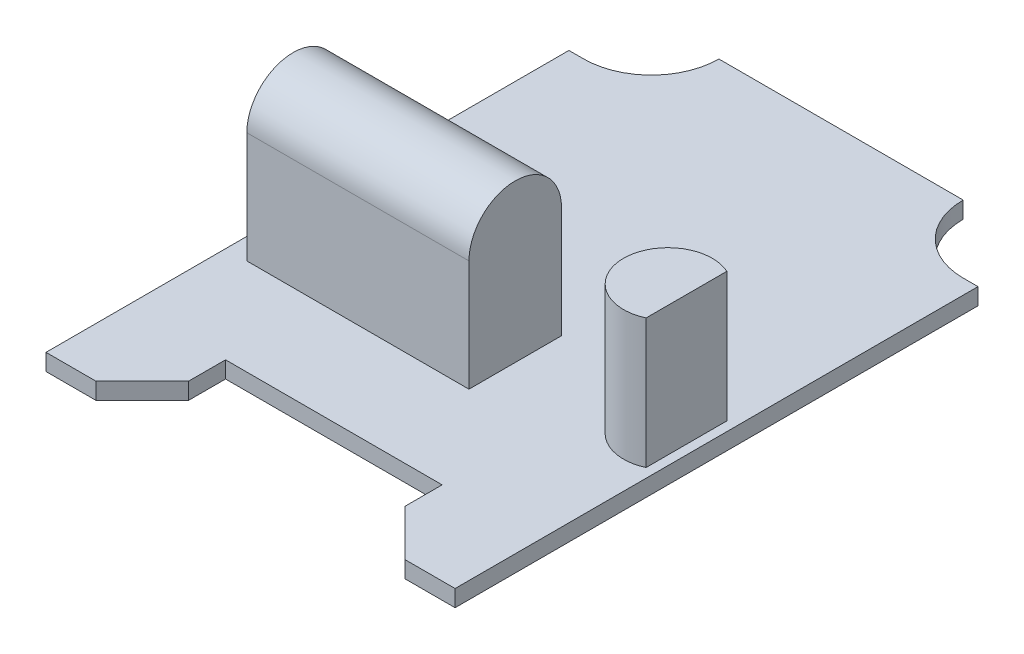
ISO-10303-21;
HEADER;
FILE_DESCRIPTION(('STEP AP214'),'2;1');
FILE_NAME('part.step','',(''),(''),'','','');
FILE_SCHEMA(('AUTOMOTIVE_DESIGN { 1 0 10303 214 1 1 1 1 }'));
ENDSEC;
DATA;
#1=APPLICATION_CONTEXT('core data for automotive mechanical design processes');
#2=APPLICATION_PROTOCOL_DEFINITION('international standard','automotive_design',2000,#1);
#3=PRODUCT_CONTEXT('',#1,'mechanical');
#4=PRODUCT('Part','Part','',(#3));
#5=PRODUCT_RELATED_PRODUCT_CATEGORY('part','',(#4));
#6=PRODUCT_DEFINITION_FORMATION('','',#4);
#7=PRODUCT_DEFINITION_CONTEXT('part definition',#1,'design');
#8=PRODUCT_DEFINITION('design','',#6,#7);
#9=PRODUCT_DEFINITION_SHAPE('','',#8);
#10=(LENGTH_UNIT() NAMED_UNIT(*) SI_UNIT(.MILLI.,.METRE.));
#11=(NAMED_UNIT(*) PLANE_ANGLE_UNIT() SI_UNIT($,.RADIAN.));
#12=(NAMED_UNIT(*) SI_UNIT($,.STERADIAN.) SOLID_ANGLE_UNIT());
#13=UNCERTAINTY_MEASURE_WITH_UNIT(LENGTH_MEASURE(1.E-05),#10,'distance_accuracy_value','');
#14=(GEOMETRIC_REPRESENTATION_CONTEXT(3) GLOBAL_UNCERTAINTY_ASSIGNED_CONTEXT((#13)) GLOBAL_UNIT_ASSIGNED_CONTEXT((#10,
#11,#12)) REPRESENTATION_CONTEXT('',''));
#15=CARTESIAN_POINT('',(0.,0.,0.));
#16=DIRECTION('',(0.,0.,1.));
#17=DIRECTION('',(1.,0.,0.));
#18=AXIS2_PLACEMENT_3D('',#15,#16,#17);
#19=CARTESIAN_POINT('',(-10.25,0.9,-31.9));
#20=DIRECTION('',(0.,-1.,0.));
#21=DIRECTION('',(0.,0.,-1.));
#22=AXIS2_PLACEMENT_3D('',#19,#20,#21);
#23=PLANE('',#22);
#24=DIRECTION('',(1.,0.,0.));
#25=VECTOR('',#24,1.);
#26=CARTESIAN_POINT('',(-8.34999999999999,0.9,0.));
#27=LINE('',#26,#25);
#28=CARTESIAN_POINT('',(-11.05,0.9,0.));
#29=VERTEX_POINT('',#28);
#30=CARTESIAN_POINT('',(-8.34999999999999,0.9,0.));
#31=VERTEX_POINT('',#30);
#32=EDGE_CURVE('E222',#29,#31,#27,.T.);
#33=ORIENTED_EDGE('',*,*,#32,.T.);
#34=DIRECTION('',(0.707106781186546,0.,-0.707106781186549));
#35=VECTOR('',#34,1.);
#36=CARTESIAN_POINT('',(-5.85,0.9,-2.5));
#37=LINE('',#36,#35);
#38=CARTESIAN_POINT('',(-5.85,0.9,-2.5));
#39=VERTEX_POINT('',#38);
#40=EDGE_CURVE('E225',#31,#39,#37,.T.);
#41=ORIENTED_EDGE('',*,*,#40,.T.);
#42=DIRECTION('',(0.,0.,-1.));
#43=VECTOR('',#42,1.);
#44=CARTESIAN_POINT('',(-5.85,0.9,-4.5));
#45=LINE('',#44,#43);
#46=CARTESIAN_POINT('',(-5.85,0.9,-4.5));
#47=VERTEX_POINT('',#46);
#48=EDGE_CURVE('E228',#39,#47,#45,.T.);
#49=ORIENTED_EDGE('',*,*,#48,.T.);
#50=DIRECTION('',(1.,0.,0.));
#51=VECTOR('',#50,1.);
#52=CARTESIAN_POINT('',(-5.85,0.9,-4.5));
#53=LINE('',#52,#51);
#54=CARTESIAN_POINT('',(5.85,0.9,-4.5));
#55=VERTEX_POINT('',#54);
#56=EDGE_CURVE('E230',#47,#55,#53,.T.);
#57=ORIENTED_EDGE('',*,*,#56,.T.);
#58=DIRECTION('',(0.,0.,1.));
#59=VECTOR('',#58,1.);
#60=CARTESIAN_POINT('',(5.85,0.9,-4.5));
#61=LINE('',#60,#59);
#62=CARTESIAN_POINT('',(5.85,0.9,-2.5));
#63=VERTEX_POINT('',#62);
#64=EDGE_CURVE('E232',#55,#63,#61,.T.);
#65=ORIENTED_EDGE('',*,*,#64,.T.);
#66=DIRECTION('',(0.707106781186546,0.,0.707106781186549));
#67=VECTOR('',#66,1.);
#68=CARTESIAN_POINT('',(5.85,0.9,-2.5));
#69=LINE('',#68,#67);
#70=CARTESIAN_POINT('',(8.34999999999999,0.9,0.));
#71=VERTEX_POINT('',#70);
#72=EDGE_CURVE('E234',#63,#71,#69,.T.);
#73=ORIENTED_EDGE('',*,*,#72,.T.);
#74=DIRECTION('',(1.,0.,0.));
#75=VECTOR('',#74,1.);
#76=CARTESIAN_POINT('',(8.34999999999999,0.9,0.));
#77=LINE('',#76,#75);
#78=CARTESIAN_POINT('',(11.05,0.9,0.));
#79=VERTEX_POINT('',#78);
#80=EDGE_CURVE('E236',#71,#79,#77,.T.);
#81=ORIENTED_EDGE('',*,*,#80,.T.);
#82=DIRECTION('',(0.,0.,-1.));
#83=VECTOR('',#82,1.);
#84=CARTESIAN_POINT('',(11.05,0.9,0.));
#85=LINE('',#84,#83);
#86=CARTESIAN_POINT('',(11.05,0.9,-28.25));
#87=VERTEX_POINT('',#86);
#88=EDGE_CURVE('E238',#79,#87,#85,.T.);
#89=ORIENTED_EDGE('',*,*,#88,.T.);
#90=DIRECTION('',(-1.,0.,0.));
#91=VECTOR('',#90,1.);
#92=CARTESIAN_POINT('',(11.05,0.9,-28.25));
#93=LINE('',#92,#91);
#94=CARTESIAN_POINT('',(10.25,0.9,-28.25));
#95=VERTEX_POINT('',#94);
#96=EDGE_CURVE('E240',#87,#95,#93,.T.);
#97=ORIENTED_EDGE('',*,*,#96,.T.);
#98=CARTESIAN_POINT('',(10.25,0.9,-31.9));
#99=DIRECTION('',(0.,-1.,0.));
#100=DIRECTION('',(0.,0.,1.));
#101=AXIS2_PLACEMENT_3D('',#98,#99,#100);
#102=CIRCLE('',#101,3.65);
#103=CARTESIAN_POINT('',(6.6,0.9,-31.9));
#104=VERTEX_POINT('',#103);
#105=EDGE_CURVE('E242',#95,#104,#102,.T.);
#106=ORIENTED_EDGE('',*,*,#105,.T.);
#107=DIRECTION('',(-1.,0.,0.));
#108=VECTOR('',#107,1.);
#109=CARTESIAN_POINT('',(-6.6,0.9,-31.9));
#110=LINE('',#109,#108);
#111=CARTESIAN_POINT('',(-6.6,0.9,-31.9));
#112=VERTEX_POINT('',#111);
#113=EDGE_CURVE('E244',#104,#112,#110,.T.);
#114=ORIENTED_EDGE('',*,*,#113,.T.);
#115=CARTESIAN_POINT('',(-10.25,0.9,-31.9));
#116=DIRECTION('',(0.,-1.,0.));
#117=DIRECTION('',(0.,0.,-1.));
#118=AXIS2_PLACEMENT_3D('',#115,#116,#117);
#119=CIRCLE('',#118,3.65);
#120=CARTESIAN_POINT('',(-10.25,0.9,-28.25));
#121=VERTEX_POINT('',#120);
#122=EDGE_CURVE('E246',#112,#121,#119,.T.);
#123=ORIENTED_EDGE('',*,*,#122,.T.);
#124=DIRECTION('',(-1.,0.,0.));
#125=VECTOR('',#124,1.);
#126=CARTESIAN_POINT('',(-11.05,0.9,-28.25));
#127=LINE('',#126,#125);
#128=CARTESIAN_POINT('',(-11.05,0.9,-28.25));
#129=VERTEX_POINT('',#128);
#130=EDGE_CURVE('E248',#121,#129,#127,.T.);
#131=ORIENTED_EDGE('',*,*,#130,.T.);
#132=DIRECTION('',(0.,0.,1.));
#133=VECTOR('',#132,1.);
#134=CARTESIAN_POINT('',(-11.05,0.9,0.));
#135=LINE('',#134,#133);
#136=EDGE_CURVE('E250',#129,#29,#135,.T.);
#137=ORIENTED_EDGE('',*,*,#136,.T.);
#138=EDGE_LOOP('',(#33,#41,#49,#57,#65,#73,#81,#89,#97,#106,#114,#123,#131,#137));
#139=FACE_BOUND('',#138,.T.);
#140=DIRECTION('',(-1.,0.,0.));
#141=VECTOR('',#140,1.);
#142=CARTESIAN_POINT('',(2.1,0.9,-14.7));
#143=LINE('',#142,#141);
#144=CARTESIAN_POINT('',(2.1,0.9,-14.7));
#145=VERTEX_POINT('',#144);
#146=CARTESIAN_POINT('',(-9.9,0.9,-14.7));
#147=VERTEX_POINT('',#146);
#148=EDGE_CURVE('E56',#145,#147,#143,.T.);
#149=ORIENTED_EDGE('',*,*,#148,.F.);
#150=DIRECTION('',(0.,0.,1.));
#151=VECTOR('',#150,1.);
#152=CARTESIAN_POINT('',(2.1,0.9,-14.7));
#153=LINE('',#152,#151);
#154=CARTESIAN_POINT('',(2.1,0.9,-9.7));
#155=VERTEX_POINT('',#154);
#156=EDGE_CURVE('E195',#145,#155,#153,.T.);
#157=ORIENTED_EDGE('',*,*,#156,.T.);
#158=DIRECTION('',(-1.,0.,0.));
#159=VECTOR('',#158,1.);
#160=CARTESIAN_POINT('',(2.1,0.9,-9.7));
#161=LINE('',#160,#159);
#162=CARTESIAN_POINT('',(-9.9,0.9,-9.7));
#163=VERTEX_POINT('',#162);
#164=EDGE_CURVE('E206',#155,#163,#161,.T.);
#165=ORIENTED_EDGE('',*,*,#164,.T.);
#166=DIRECTION('',(0.,0.,1.));
#167=VECTOR('',#166,1.);
#168=CARTESIAN_POINT('',(-9.9,0.9,-14.7));
#169=LINE('',#168,#167);
#170=EDGE_CURVE('E187',#147,#163,#169,.T.);
#171=ORIENTED_EDGE('',*,*,#170,.F.);
#172=EDGE_LOOP('',(#149,#157,#165,#171));
#173=FACE_BOUND('',#172,.T.);
#174=CARTESIAN_POINT('',(9.55,0.9,-13.));
#175=DIRECTION('',(0.,1.,0.));
#176=DIRECTION('',(0.,0.,1.));
#177=AXIS2_PLACEMENT_3D('',#174,#175,#176);
#178=CIRCLE('',#177,2.4);
#179=CARTESIAN_POINT('',(10.55,0.9,-15.1817424229271));
#180=VERTEX_POINT('',#179);
#181=CARTESIAN_POINT('',(10.55,0.9,-10.8182575770729));
#182=VERTEX_POINT('',#181);
#183=EDGE_CURVE('E186',#180,#182,#178,.T.);
#184=ORIENTED_EDGE('',*,*,#183,.F.);
#185=DIRECTION('',(0.,0.,-1.));
#186=VECTOR('',#185,1.);
#187=CARTESIAN_POINT('',(10.55,0.9,-15.1817424229271));
#188=LINE('',#187,#186);
#189=EDGE_CURVE('E48',#182,#180,#188,.T.);
#190=ORIENTED_EDGE('',*,*,#189,.F.);
#191=EDGE_LOOP('',(#184,#190));
#192=FACE_BOUND('',#191,.T.);
#193=ADVANCED_FACE('F34',(#139,#173,#192),#23,.F.);
#194=CARTESIAN_POINT('',(-8.34999999999999,0.9,0.));
#195=DIRECTION('',(0.,0.,-1.));
#196=DIRECTION('',(-1.,0.,0.));
#197=AXIS2_PLACEMENT_3D('',#194,#195,#196);
#198=PLANE('',#197);
#199=DIRECTION('',(1.,0.,0.));
#200=VECTOR('',#199,1.);
#201=CARTESIAN_POINT('',(-8.34999999999999,0.,0.));
#202=LINE('',#201,#200);
#203=CARTESIAN_POINT('',(-11.05,0.,0.));
#204=VERTEX_POINT('',#203);
#205=CARTESIAN_POINT('',(-8.34999999999999,0.,0.));
#206=VERTEX_POINT('',#205);
#207=EDGE_CURVE('E216',#204,#206,#202,.T.);
#208=ORIENTED_EDGE('',*,*,#207,.T.);
#209=DIRECTION('',(0.,-1.,0.));
#210=VECTOR('',#209,1.);
#211=CARTESIAN_POINT('',(-8.34999999999999,0.9,0.));
#212=LINE('',#211,#210);
#213=EDGE_CURVE('E11',#31,#206,#212,.T.);
#214=ORIENTED_EDGE('',*,*,#213,.F.);
#215=ORIENTED_EDGE('',*,*,#32,.F.);
#216=DIRECTION('',(0.,-1.,0.));
#217=VECTOR('',#216,1.);
#218=CARTESIAN_POINT('',(-11.05,0.9,0.));
#219=LINE('',#218,#217);
#220=EDGE_CURVE('E252',#29,#204,#219,.T.);
#221=ORIENTED_EDGE('',*,*,#220,.T.);
#222=EDGE_LOOP('',(#208,#214,#215,#221));
#223=FACE_BOUND('',#222,.T.);
#224=ADVANCED_FACE('F36',(#223),#198,.F.);
#225=CARTESIAN_POINT('',(-5.85,0.9,-2.5));
#226=DIRECTION('',(-0.707106781186549,0.,-0.707106781186546));
#227=DIRECTION('',(-0.707106781186546,0.,0.707106781186549));
#228=AXIS2_PLACEMENT_3D('',#225,#226,#227);
#229=PLANE('',#228);
#230=DIRECTION('',(0.707106781186546,0.,-0.707106781186549));
#231=VECTOR('',#230,1.);
#232=CARTESIAN_POINT('',(-5.85,0.,-2.5));
#233=LINE('',#232,#231);
#234=CARTESIAN_POINT('',(-5.85,0.,-2.5));
#235=VERTEX_POINT('',#234);
#236=EDGE_CURVE('E255',#206,#235,#233,.T.);
#237=ORIENTED_EDGE('',*,*,#236,.T.);
#238=DIRECTION('',(0.,-1.,0.));
#239=VECTOR('',#238,1.);
#240=CARTESIAN_POINT('',(-5.85,0.9,-2.5));
#241=LINE('',#240,#239);
#242=EDGE_CURVE('E42',#39,#235,#241,.T.);
#243=ORIENTED_EDGE('',*,*,#242,.F.);
#244=ORIENTED_EDGE('',*,*,#40,.F.);
#245=ORIENTED_EDGE('',*,*,#213,.T.);
#246=EDGE_LOOP('',(#237,#243,#244,#245));
#247=FACE_BOUND('',#246,.T.);
#248=ADVANCED_FACE('F341',(#247),#229,.F.);
#249=CARTESIAN_POINT('',(-5.85,0.9,-4.5));
#250=DIRECTION('',(-1.,0.,0.));
#251=DIRECTION('',(0.,0.,1.));
#252=AXIS2_PLACEMENT_3D('',#249,#250,#251);
#253=PLANE('',#252);
#254=DIRECTION('',(0.,0.,-1.));
#255=VECTOR('',#254,1.);
#256=CARTESIAN_POINT('',(-5.85,0.,-4.5));
#257=LINE('',#256,#255);
#258=CARTESIAN_POINT('',(-5.85,0.,-4.5));
#259=VERTEX_POINT('',#258);
#260=EDGE_CURVE('E257',#235,#259,#257,.T.);
#261=ORIENTED_EDGE('',*,*,#260,.T.);
#262=DIRECTION('',(0.,-1.,0.));
#263=VECTOR('',#262,1.);
#264=CARTESIAN_POINT('',(-5.85,0.9,-4.5));
#265=LINE('',#264,#263);
#266=EDGE_CURVE('E312',#47,#259,#265,.T.);
#267=ORIENTED_EDGE('',*,*,#266,.F.);
#268=ORIENTED_EDGE('',*,*,#48,.F.);
#269=ORIENTED_EDGE('',*,*,#242,.T.);
#270=EDGE_LOOP('',(#261,#267,#268,#269));
#271=FACE_BOUND('',#270,.T.);
#272=ADVANCED_FACE('F319',(#271),#253,.F.);
#273=CARTESIAN_POINT('',(-5.85,0.9,-4.5));
#274=DIRECTION('',(0.,0.,-1.));
#275=DIRECTION('',(-1.,0.,0.));
#276=AXIS2_PLACEMENT_3D('',#273,#274,#275);
#277=PLANE('',#276);
#278=DIRECTION('',(1.,0.,0.));
#279=VECTOR('',#278,1.);
#280=CARTESIAN_POINT('',(-5.85,0.,-4.5));
#281=LINE('',#280,#279);
#282=CARTESIAN_POINT('',(5.85,0.,-4.5));
#283=VERTEX_POINT('',#282);
#284=EDGE_CURVE('E259',#259,#283,#281,.T.);
#285=ORIENTED_EDGE('',*,*,#284,.T.);
#286=DIRECTION('',(0.,-1.,0.));
#287=VECTOR('',#286,1.);
#288=CARTESIAN_POINT('',(5.85,0.9,-4.5));
#289=LINE('',#288,#287);
#290=EDGE_CURVE('E309',#55,#283,#289,.T.);
#291=ORIENTED_EDGE('',*,*,#290,.F.);
#292=ORIENTED_EDGE('',*,*,#56,.F.);
#293=ORIENTED_EDGE('',*,*,#266,.T.);
#294=EDGE_LOOP('',(#285,#291,#292,#293));
#295=FACE_BOUND('',#294,.T.);
#296=ADVANCED_FACE('F330',(#295),#277,.F.);
#297=CARTESIAN_POINT('',(5.85,0.9,-4.5));
#298=DIRECTION('',(1.,0.,0.));
#299=DIRECTION('',(0.,0.,-1.));
#300=AXIS2_PLACEMENT_3D('',#297,#298,#299);
#301=PLANE('',#300);
#302=DIRECTION('',(0.,0.,1.));
#303=VECTOR('',#302,1.);
#304=CARTESIAN_POINT('',(5.85,0.,-4.5));
#305=LINE('',#304,#303);
#306=CARTESIAN_POINT('',(5.85,0.,-2.5));
#307=VERTEX_POINT('',#306);
#308=EDGE_CURVE('E261',#283,#307,#305,.T.);
#309=ORIENTED_EDGE('',*,*,#308,.T.);
#310=DIRECTION('',(0.,-1.,0.));
#311=VECTOR('',#310,1.);
#312=CARTESIAN_POINT('',(5.85,0.9,-2.5));
#313=LINE('',#312,#311);
#314=EDGE_CURVE('E306',#63,#307,#313,.T.);
#315=ORIENTED_EDGE('',*,*,#314,.F.);
#316=ORIENTED_EDGE('',*,*,#64,.F.);
#317=ORIENTED_EDGE('',*,*,#290,.T.);
#318=EDGE_LOOP('',(#309,#315,#316,#317));
#319=FACE_BOUND('',#318,.T.);
#320=ADVANCED_FACE('F334',(#319),#301,.F.);
#321=CARTESIAN_POINT('',(5.85,0.9,-2.5));
#322=DIRECTION('',(0.707106781186549,0.,-0.707106781186546));
#323=DIRECTION('',(-0.707106781186546,0.,-0.707106781186549));
#324=AXIS2_PLACEMENT_3D('',#321,#322,#323);
#325=PLANE('',#324);
#326=DIRECTION('',(0.707106781186546,0.,0.707106781186549));
#327=VECTOR('',#326,1.);
#328=CARTESIAN_POINT('',(5.85,0.,-2.5));
#329=LINE('',#328,#327);
#330=CARTESIAN_POINT('',(8.34999999999999,0.,0.));
#331=VERTEX_POINT('',#330);
#332=EDGE_CURVE('E263',#307,#331,#329,.T.);
#333=ORIENTED_EDGE('',*,*,#332,.T.);
#334=DIRECTION('',(0.,-1.,0.));
#335=VECTOR('',#334,1.);
#336=CARTESIAN_POINT('',(8.34999999999999,0.9,0.));
#337=LINE('',#336,#335);
#338=EDGE_CURVE('E303',#71,#331,#337,.T.);
#339=ORIENTED_EDGE('',*,*,#338,.F.);
#340=ORIENTED_EDGE('',*,*,#72,.F.);
#341=ORIENTED_EDGE('',*,*,#314,.T.);
#342=EDGE_LOOP('',(#333,#339,#340,#341));
#343=FACE_BOUND('',#342,.T.);
#344=ADVANCED_FACE('F384',(#343),#325,.F.);
#345=CARTESIAN_POINT('',(8.34999999999999,0.9,0.));
#346=DIRECTION('',(0.,0.,-1.));
#347=DIRECTION('',(-1.,0.,0.));
#348=AXIS2_PLACEMENT_3D('',#345,#346,#347);
#349=PLANE('',#348);
#350=DIRECTION('',(1.,0.,0.));
#351=VECTOR('',#350,1.);
#352=CARTESIAN_POINT('',(8.34999999999999,0.,0.));
#353=LINE('',#352,#351);
#354=CARTESIAN_POINT('',(11.05,0.,0.));
#355=VERTEX_POINT('',#354);
#356=EDGE_CURVE('E265',#331,#355,#353,.T.);
#357=ORIENTED_EDGE('',*,*,#356,.T.);
#358=DIRECTION('',(0.,-1.,0.));
#359=VECTOR('',#358,1.);
#360=CARTESIAN_POINT('',(11.05,0.9,0.));
#361=LINE('',#360,#359);
#362=EDGE_CURVE('E300',#79,#355,#361,.T.);
#363=ORIENTED_EDGE('',*,*,#362,.F.);
#364=ORIENTED_EDGE('',*,*,#80,.F.);
#365=ORIENTED_EDGE('',*,*,#338,.T.);
#366=EDGE_LOOP('',(#357,#363,#364,#365));
#367=FACE_BOUND('',#366,.T.);
#368=ADVANCED_FACE('F382',(#367),#349,.F.);
#369=CARTESIAN_POINT('',(11.05,0.9,0.));
#370=DIRECTION('',(-1.,0.,0.));
#371=DIRECTION('',(0.,0.,1.));
#372=AXIS2_PLACEMENT_3D('',#369,#370,#371);
#373=PLANE('',#372);
#374=DIRECTION('',(0.,0.,-1.));
#375=VECTOR('',#374,1.);
#376=CARTESIAN_POINT('',(11.05,0.,0.));
#377=LINE('',#376,#375);
#378=CARTESIAN_POINT('',(11.05,0.,-28.25));
#379=VERTEX_POINT('',#378);
#380=EDGE_CURVE('E267',#355,#379,#377,.T.);
#381=ORIENTED_EDGE('',*,*,#380,.T.);
#382=DIRECTION('',(0.,-1.,0.));
#383=VECTOR('',#382,1.);
#384=CARTESIAN_POINT('',(11.05,0.9,-28.25));
#385=LINE('',#384,#383);
#386=EDGE_CURVE('E297',#87,#379,#385,.T.);
#387=ORIENTED_EDGE('',*,*,#386,.F.);
#388=ORIENTED_EDGE('',*,*,#88,.F.);
#389=ORIENTED_EDGE('',*,*,#362,.T.);
#390=EDGE_LOOP('',(#381,#387,#388,#389));
#391=FACE_BOUND('',#390,.T.);
#392=ADVANCED_FACE('F377',(#391),#373,.F.);
#393=CARTESIAN_POINT('',(11.05,0.9,-28.25));
#394=DIRECTION('',(0.,0.,1.));
#395=DIRECTION('',(1.,0.,0.));
#396=AXIS2_PLACEMENT_3D('',#393,#394,#395);
#397=PLANE('',#396);
#398=DIRECTION('',(-1.,0.,0.));
#399=VECTOR('',#398,1.);
#400=CARTESIAN_POINT('',(11.05,0.,-28.25));
#401=LINE('',#400,#399);
#402=CARTESIAN_POINT('',(10.25,0.,-28.25));
#403=VERTEX_POINT('',#402);
#404=EDGE_CURVE('E269',#379,#403,#401,.T.);
#405=ORIENTED_EDGE('',*,*,#404,.T.);
#406=DIRECTION('',(0.,-1.,0.));
#407=VECTOR('',#406,1.);
#408=CARTESIAN_POINT('',(10.25,0.9,-28.25));
#409=LINE('',#408,#407);
#410=EDGE_CURVE('E294',#95,#403,#409,.T.);
#411=ORIENTED_EDGE('',*,*,#410,.F.);
#412=ORIENTED_EDGE('',*,*,#96,.F.);
#413=ORIENTED_EDGE('',*,*,#386,.T.);
#414=EDGE_LOOP('',(#405,#411,#412,#413));
#415=FACE_BOUND('',#414,.T.);
#416=ADVANCED_FACE('F372',(#415),#397,.F.);
#417=CARTESIAN_POINT('',(10.25,0.9,-31.9));
#418=DIRECTION('',(0.,-1.,0.));
#419=DIRECTION('',(0.,0.,-1.));
#420=AXIS2_PLACEMENT_3D('',#417,#418,#419);
#421=CYLINDRICAL_SURFACE('',#420,3.65);
#422=CARTESIAN_POINT('',(10.25,0.,-31.9));
#423=DIRECTION('',(0.,-1.,0.));
#424=DIRECTION('',(0.,0.,1.));
#425=AXIS2_PLACEMENT_3D('',#422,#423,#424);
#426=CIRCLE('',#425,3.65);
#427=CARTESIAN_POINT('',(6.6,0.,-31.9));
#428=VERTEX_POINT('',#427);
#429=EDGE_CURVE('E271',#403,#428,#426,.T.);
#430=ORIENTED_EDGE('',*,*,#429,.T.);
#431=DIRECTION('',(0.,-1.,0.));
#432=VECTOR('',#431,1.);
#433=CARTESIAN_POINT('',(6.6,0.9,-31.9));
#434=LINE('',#433,#432);
#435=EDGE_CURVE('E291',#104,#428,#434,.T.);
#436=ORIENTED_EDGE('',*,*,#435,.F.);
#437=ORIENTED_EDGE('',*,*,#105,.F.);
#438=ORIENTED_EDGE('',*,*,#410,.T.);
#439=EDGE_LOOP('',(#430,#436,#437,#438));
#440=FACE_BOUND('',#439,.T.);
#441=ADVANCED_FACE('F368',(#440),#421,.F.);
#442=CARTESIAN_POINT('',(-6.6,0.9,-31.9));
#443=DIRECTION('',(0.,0.,1.));
#444=DIRECTION('',(1.,0.,0.));
#445=AXIS2_PLACEMENT_3D('',#442,#443,#444);
#446=PLANE('',#445);
#447=DIRECTION('',(-1.,0.,0.));
#448=VECTOR('',#447,1.);
#449=CARTESIAN_POINT('',(-6.6,0.,-31.9));
#450=LINE('',#449,#448);
#451=CARTESIAN_POINT('',(-6.6,0.,-31.9));
#452=VERTEX_POINT('',#451);
#453=EDGE_CURVE('E273',#428,#452,#450,.T.);
#454=ORIENTED_EDGE('',*,*,#453,.T.);
#455=DIRECTION('',(0.,-1.,0.));
#456=VECTOR('',#455,1.);
#457=CARTESIAN_POINT('',(-6.6,0.9,-31.9));
#458=LINE('',#457,#456);
#459=EDGE_CURVE('E288',#112,#452,#458,.T.);
#460=ORIENTED_EDGE('',*,*,#459,.F.);
#461=ORIENTED_EDGE('',*,*,#113,.F.);
#462=ORIENTED_EDGE('',*,*,#435,.T.);
#463=EDGE_LOOP('',(#454,#460,#461,#462));
#464=FACE_BOUND('',#463,.T.);
#465=ADVANCED_FACE('F363',(#464),#446,.F.);
#466=CARTESIAN_POINT('',(-10.25,0.9,-31.9));
#467=DIRECTION('',(0.,-1.,0.));
#468=DIRECTION('',(0.,0.,-1.));
#469=AXIS2_PLACEMENT_3D('',#466,#467,#468);
#470=CYLINDRICAL_SURFACE('',#469,3.65);
#471=CARTESIAN_POINT('',(-10.25,0.,-31.9));
#472=DIRECTION('',(0.,-1.,0.));
#473=DIRECTION('',(0.,0.,-1.));
#474=AXIS2_PLACEMENT_3D('',#471,#472,#473);
#475=CIRCLE('',#474,3.65);
#476=CARTESIAN_POINT('',(-10.25,0.,-28.25));
#477=VERTEX_POINT('',#476);
#478=EDGE_CURVE('E275',#452,#477,#475,.T.);
#479=ORIENTED_EDGE('',*,*,#478,.T.);
#480=DIRECTION('',(0.,-1.,0.));
#481=VECTOR('',#480,1.);
#482=CARTESIAN_POINT('',(-10.25,0.9,-28.25));
#483=LINE('',#482,#481);
#484=EDGE_CURVE('E285',#121,#477,#483,.T.);
#485=ORIENTED_EDGE('',*,*,#484,.F.);
#486=ORIENTED_EDGE('',*,*,#122,.F.);
#487=ORIENTED_EDGE('',*,*,#459,.T.);
#488=EDGE_LOOP('',(#479,#485,#486,#487));
#489=FACE_BOUND('',#488,.T.);
#490=ADVANCED_FACE('F357',(#489),#470,.F.);
#491=CARTESIAN_POINT('',(-11.05,0.9,-28.25));
#492=DIRECTION('',(0.,0.,1.));
#493=DIRECTION('',(1.,0.,0.));
#494=AXIS2_PLACEMENT_3D('',#491,#492,#493);
#495=PLANE('',#494);
#496=DIRECTION('',(-1.,0.,0.));
#497=VECTOR('',#496,1.);
#498=CARTESIAN_POINT('',(-11.05,0.,-28.25));
#499=LINE('',#498,#497);
#500=CARTESIAN_POINT('',(-11.05,0.,-28.25));
#501=VERTEX_POINT('',#500);
#502=EDGE_CURVE('E277',#477,#501,#499,.T.);
#503=ORIENTED_EDGE('',*,*,#502,.T.);
#504=DIRECTION('',(0.,-1.,0.));
#505=VECTOR('',#504,1.);
#506=CARTESIAN_POINT('',(-11.05,0.9,-28.25));
#507=LINE('',#506,#505);
#508=EDGE_CURVE('E282',#129,#501,#507,.T.);
#509=ORIENTED_EDGE('',*,*,#508,.F.);
#510=ORIENTED_EDGE('',*,*,#130,.F.);
#511=ORIENTED_EDGE('',*,*,#484,.T.);
#512=EDGE_LOOP('',(#503,#509,#510,#511));
#513=FACE_BOUND('',#512,.T.);
#514=ADVANCED_FACE('F353',(#513),#495,.F.);
#515=CARTESIAN_POINT('',(-11.05,0.9,0.));
#516=DIRECTION('',(1.,0.,0.));
#517=DIRECTION('',(0.,0.,-1.));
#518=AXIS2_PLACEMENT_3D('',#515,#516,#517);
#519=PLANE('',#518);
#520=DIRECTION('',(0.,0.,1.));
#521=VECTOR('',#520,1.);
#522=CARTESIAN_POINT('',(-11.05,0.,0.));
#523=LINE('',#522,#521);
#524=EDGE_CURVE('E226',#501,#204,#523,.T.);
#525=ORIENTED_EDGE('',*,*,#524,.T.);
#526=ORIENTED_EDGE('',*,*,#220,.F.);
#527=ORIENTED_EDGE('',*,*,#136,.F.);
#528=ORIENTED_EDGE('',*,*,#508,.T.);
#529=EDGE_LOOP('',(#525,#526,#527,#528));
#530=FACE_BOUND('',#529,.T.);
#531=ADVANCED_FACE('F348',(#530),#519,.F.);
#532=CARTESIAN_POINT('',(-10.25,0.,-31.9));
#533=DIRECTION('',(0.,-1.,0.));
#534=DIRECTION('',(0.,0.,-1.));
#535=AXIS2_PLACEMENT_3D('',#532,#533,#534);
#536=PLANE('',#535);
#537=ORIENTED_EDGE('',*,*,#207,.F.);
#538=ORIENTED_EDGE('',*,*,#524,.F.);
#539=ORIENTED_EDGE('',*,*,#502,.F.);
#540=ORIENTED_EDGE('',*,*,#478,.F.);
#541=ORIENTED_EDGE('',*,*,#453,.F.);
#542=ORIENTED_EDGE('',*,*,#429,.F.);
#543=ORIENTED_EDGE('',*,*,#404,.F.);
#544=ORIENTED_EDGE('',*,*,#380,.F.);
#545=ORIENTED_EDGE('',*,*,#356,.F.);
#546=ORIENTED_EDGE('',*,*,#332,.F.);
#547=ORIENTED_EDGE('',*,*,#308,.F.);
#548=ORIENTED_EDGE('',*,*,#284,.F.);
#549=ORIENTED_EDGE('',*,*,#260,.F.);
#550=ORIENTED_EDGE('',*,*,#236,.F.);
#551=EDGE_LOOP('',(#537,#538,#539,#540,#541,#542,#543,#544,#545,#546,#547,#548,#549,#550));
#552=FACE_BOUND('',#551,.T.);
#553=ADVANCED_FACE('F325',(#552),#536,.T.);
#554=CARTESIAN_POINT('',(2.1,0.9,-14.7));
#555=DIRECTION('',(0.,0.,-1.));
#556=DIRECTION('',(-1.,0.,0.));
#557=AXIS2_PLACEMENT_3D('',#554,#555,#556);
#558=PLANE('',#557);
#559=DIRECTION('',(0.,-1.,0.));
#560=VECTOR('',#559,1.);
#561=CARTESIAN_POINT('',(-9.9,0.9,-14.7));
#562=LINE('',#561,#560);
#563=CARTESIAN_POINT('',(-9.9,6.9,-14.7));
#564=VERTEX_POINT('',#563);
#565=EDGE_CURVE('E198',#564,#147,#562,.T.);
#566=ORIENTED_EDGE('',*,*,#565,.F.);
#567=DIRECTION('',(-1.,0.,0.));
#568=VECTOR('',#567,1.);
#569=CARTESIAN_POINT('',(2.1,6.9,-14.7));
#570=LINE('',#569,#568);
#571=CARTESIAN_POINT('',(2.1,6.9,-14.7));
#572=VERTEX_POINT('',#571);
#573=EDGE_CURVE('E217',#572,#564,#570,.T.);
#574=ORIENTED_EDGE('',*,*,#573,.F.);
#575=DIRECTION('',(0.,-1.,0.));
#576=VECTOR('',#575,1.);
#577=CARTESIAN_POINT('',(2.1,0.9,-14.7));
#578=LINE('',#577,#576);
#579=EDGE_CURVE('E204',#572,#145,#578,.T.);
#580=ORIENTED_EDGE('',*,*,#579,.T.);
#581=ORIENTED_EDGE('',*,*,#148,.T.);
#582=EDGE_LOOP('',(#566,#574,#580,#581));
#583=FACE_BOUND('',#582,.T.);
#584=ADVANCED_FACE('F404',(#583),#558,.T.);
#585=CARTESIAN_POINT('',(2.1,6.9,-12.2));
#586=DIRECTION('',(-1.,0.,0.));
#587=DIRECTION('',(0.,0.,1.));
#588=AXIS2_PLACEMENT_3D('',#585,#586,#587);
#589=CYLINDRICAL_SURFACE('',#588,2.5);
#590=CARTESIAN_POINT('',(-9.9,6.9,-12.2));
#591=DIRECTION('',(-1.,0.,0.));
#592=DIRECTION('',(0.,0.,-1.));
#593=AXIS2_PLACEMENT_3D('',#590,#591,#592);
#594=CIRCLE('',#593,2.5);
#595=CARTESIAN_POINT('',(-9.9,6.9,-9.7));
#596=VERTEX_POINT('',#595);
#597=EDGE_CURVE('E210',#596,#564,#594,.T.);
#598=ORIENTED_EDGE('',*,*,#597,.F.);
#599=DIRECTION('',(-1.,0.,0.));
#600=VECTOR('',#599,1.);
#601=CARTESIAN_POINT('',(2.1,6.9,-9.7));
#602=LINE('',#601,#600);
#603=CARTESIAN_POINT('',(2.1,6.9,-9.7));
#604=VERTEX_POINT('',#603);
#605=EDGE_CURVE('E219',#604,#596,#602,.T.);
#606=ORIENTED_EDGE('',*,*,#605,.F.);
#607=CARTESIAN_POINT('',(2.1,6.9,-12.2));
#608=DIRECTION('',(-1.,0.,0.));
#609=DIRECTION('',(0.,0.,-1.));
#610=AXIS2_PLACEMENT_3D('',#607,#608,#609);
#611=CIRCLE('',#610,2.5);
#612=EDGE_CURVE('E201',#604,#572,#611,.T.);
#613=ORIENTED_EDGE('',*,*,#612,.T.);
#614=ORIENTED_EDGE('',*,*,#573,.T.);
#615=EDGE_LOOP('',(#598,#606,#613,#614));
#616=FACE_BOUND('',#615,.T.);
#617=ADVANCED_FACE('F463',(#616),#589,.T.);
#618=CARTESIAN_POINT('',(2.1,0.9,-9.7));
#619=DIRECTION('',(0.,0.,1.));
#620=DIRECTION('',(1.,0.,0.));
#621=AXIS2_PLACEMENT_3D('',#618,#619,#620);
#622=PLANE('',#621);
#623=DIRECTION('',(0.,1.,0.));
#624=VECTOR('',#623,1.);
#625=CARTESIAN_POINT('',(-9.9,0.9,-9.7));
#626=LINE('',#625,#624);
#627=EDGE_CURVE('E190',#163,#596,#626,.T.);
#628=ORIENTED_EDGE('',*,*,#627,.F.);
#629=ORIENTED_EDGE('',*,*,#164,.F.);
#630=DIRECTION('',(0.,1.,0.));
#631=VECTOR('',#630,1.);
#632=CARTESIAN_POINT('',(2.1,0.9,-9.7));
#633=LINE('',#632,#631);
#634=EDGE_CURVE('E197',#155,#604,#633,.T.);
#635=ORIENTED_EDGE('',*,*,#634,.T.);
#636=ORIENTED_EDGE('',*,*,#605,.T.);
#637=EDGE_LOOP('',(#628,#629,#635,#636));
#638=FACE_BOUND('',#637,.T.);
#639=ADVANCED_FACE('F400',(#638),#622,.T.);
#640=CARTESIAN_POINT('',(2.1,6.9,-12.2));
#641=DIRECTION('',(1.,0.,0.));
#642=DIRECTION('',(0.,0.,-1.));
#643=AXIS2_PLACEMENT_3D('',#640,#641,#642);
#644=PLANE('',#643);
#645=ORIENTED_EDGE('',*,*,#156,.F.);
#646=ORIENTED_EDGE('',*,*,#579,.F.);
#647=ORIENTED_EDGE('',*,*,#612,.F.);
#648=ORIENTED_EDGE('',*,*,#634,.F.);
#649=EDGE_LOOP('',(#645,#646,#647,#648));
#650=FACE_BOUND('',#649,.T.);
#651=ADVANCED_FACE('F478',(#650),#644,.T.);
#652=CARTESIAN_POINT('',(-9.9,6.9,-12.2));
#653=DIRECTION('',(1.,0.,0.));
#654=DIRECTION('',(0.,0.,-1.));
#655=AXIS2_PLACEMENT_3D('',#652,#653,#654);
#656=PLANE('',#655);
#657=ORIENTED_EDGE('',*,*,#170,.T.);
#658=ORIENTED_EDGE('',*,*,#627,.T.);
#659=ORIENTED_EDGE('',*,*,#597,.T.);
#660=ORIENTED_EDGE('',*,*,#565,.T.);
#661=EDGE_LOOP('',(#657,#658,#659,#660));
#662=FACE_BOUND('',#661,.T.);
#663=ADVANCED_FACE('F485',(#662),#656,.F.);
#664=CARTESIAN_POINT('',(9.55,7.9,-13.));
#665=DIRECTION('',(0.,-1.,0.));
#666=DIRECTION('',(0.,0.,-1.));
#667=AXIS2_PLACEMENT_3D('',#664,#665,#666);
#668=CYLINDRICAL_SURFACE('',#667,2.4);
#669=ORIENTED_EDGE('',*,*,#183,.T.);
#670=DIRECTION('',(0.,-1.,0.));
#671=VECTOR('',#670,1.);
#672=CARTESIAN_POINT('',(10.55,7.9,-10.8182575770729));
#673=LINE('',#672,#671);
#674=CARTESIAN_POINT('',(10.55,7.9,-10.8182575770729));
#675=VERTEX_POINT('',#674);
#676=EDGE_CURVE('E174',#675,#182,#673,.T.);
#677=ORIENTED_EDGE('',*,*,#676,.F.);
#678=CARTESIAN_POINT('',(9.55,7.9,-13.));
#679=DIRECTION('',(0.,1.,0.));
#680=DIRECTION('',(0.,0.,1.));
#681=AXIS2_PLACEMENT_3D('',#678,#679,#680);
#682=CIRCLE('',#681,2.4);
#683=CARTESIAN_POINT('',(10.55,7.9,-15.1817424229271));
#684=VERTEX_POINT('',#683);
#685=EDGE_CURVE('E180',#684,#675,#682,.T.);
#686=ORIENTED_EDGE('',*,*,#685,.F.);
#687=DIRECTION('',(0.,-1.,0.));
#688=VECTOR('',#687,1.);
#689=CARTESIAN_POINT('',(10.55,7.9,-15.1817424229271));
#690=LINE('',#689,#688);
#691=EDGE_CURVE('E177',#684,#180,#690,.T.);
#692=ORIENTED_EDGE('',*,*,#691,.T.);
#693=EDGE_LOOP('',(#669,#677,#686,#692));
#694=FACE_BOUND('',#693,.T.);
#695=ADVANCED_FACE('F185',(#694),#668,.T.);
#696=CARTESIAN_POINT('',(10.55,7.9,-15.1817424229271));
#697=DIRECTION('',(-1.,0.,0.));
#698=DIRECTION('',(0.,0.,1.));
#699=AXIS2_PLACEMENT_3D('',#696,#697,#698);
#700=PLANE('',#699);
#701=ORIENTED_EDGE('',*,*,#189,.T.);
#702=ORIENTED_EDGE('',*,*,#691,.F.);
#703=DIRECTION('',(0.,0.,-1.));
#704=VECTOR('',#703,1.);
#705=CARTESIAN_POINT('',(10.55,7.9,-15.1817424229271));
#706=LINE('',#705,#704);
#707=EDGE_CURVE('E170',#675,#684,#706,.T.);
#708=ORIENTED_EDGE('',*,*,#707,.F.);
#709=ORIENTED_EDGE('',*,*,#676,.T.);
#710=EDGE_LOOP('',(#701,#702,#708,#709));
#711=FACE_BOUND('',#710,.T.);
#712=ADVANCED_FACE('F172',(#711),#700,.F.);
#713=CARTESIAN_POINT('',(9.55,7.9,-13.));
#714=DIRECTION('',(0.,1.,0.));
#715=DIRECTION('',(0.,0.,1.));
#716=AXIS2_PLACEMENT_3D('',#713,#714,#715);
#717=PLANE('',#716);
#718=ORIENTED_EDGE('',*,*,#685,.T.);
#719=ORIENTED_EDGE('',*,*,#707,.T.);
#720=EDGE_LOOP('',(#718,#719));
#721=FACE_BOUND('',#720,.T.);
#722=ADVANCED_FACE('F182',(#721),#717,.T.);
#723=CLOSED_SHELL('',(#193,#224,#248,#272,#296,#320,#344,#368,#392,#416,#441,#465,#490,#514,
#531,#553,#584,#617,#639,#651,#663,#695,#712,#722));
#724=MANIFOLD_SOLID_BREP('B2',#723);
#725=ADVANCED_BREP_SHAPE_REPRESENTATION('',(#18,#724),#14);
#726=SHAPE_DEFINITION_REPRESENTATION(#9,#725);
ENDSEC;
END-ISO-10303-21;
